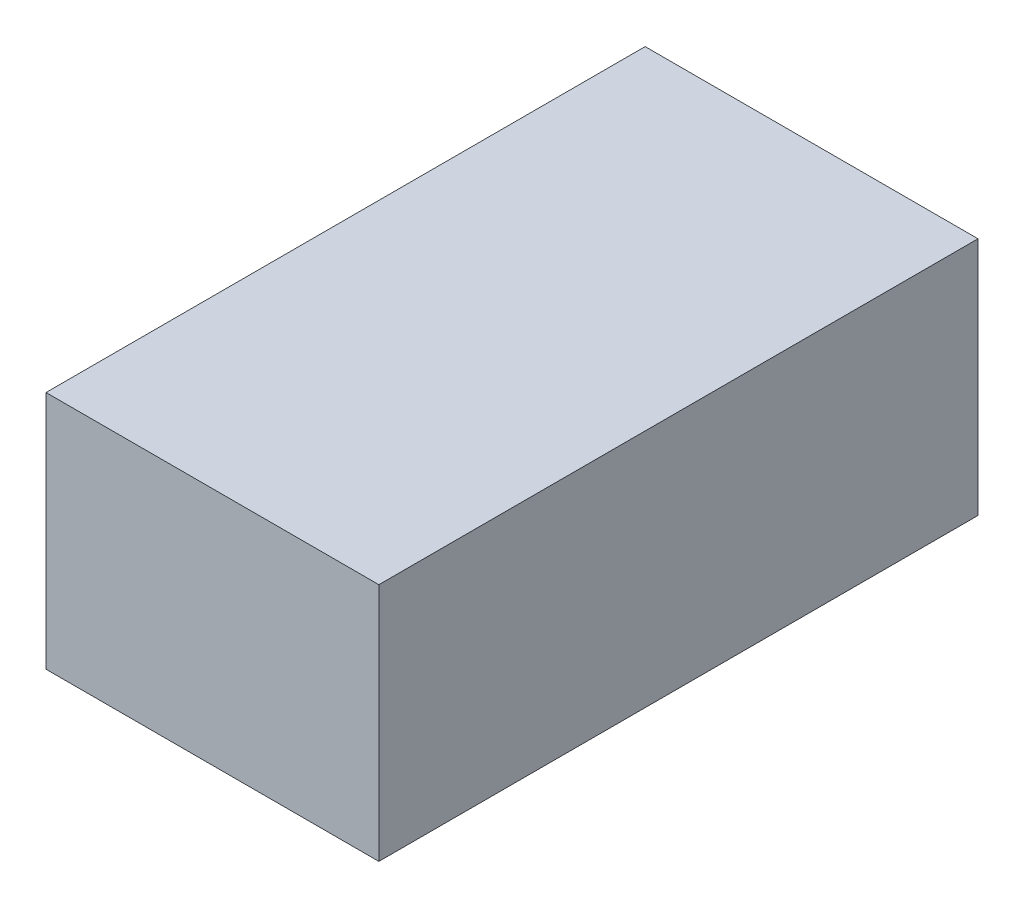
ISO-10303-21;
HEADER;
FILE_DESCRIPTION(('STEP AP214'),'2;1');
FILE_NAME('part.step','',(''),(''),'','','');
FILE_SCHEMA(('AUTOMOTIVE_DESIGN { 1 0 10303 214 1 1 1 1 }'));
ENDSEC;
DATA;
#1=APPLICATION_CONTEXT('core data for automotive mechanical design processes');
#2=APPLICATION_PROTOCOL_DEFINITION('international standard','automotive_design',2000,#1);
#3=PRODUCT_CONTEXT('',#1,'mechanical');
#4=PRODUCT('Part','Part','',(#3));
#5=PRODUCT_RELATED_PRODUCT_CATEGORY('part','',(#4));
#6=PRODUCT_DEFINITION_FORMATION('','',#4);
#7=PRODUCT_DEFINITION_CONTEXT('part definition',#1,'design');
#8=PRODUCT_DEFINITION('design','',#6,#7);
#9=PRODUCT_DEFINITION_SHAPE('','',#8);
#10=(LENGTH_UNIT() NAMED_UNIT(*) SI_UNIT(.MILLI.,.METRE.));
#11=(NAMED_UNIT(*) PLANE_ANGLE_UNIT() SI_UNIT($,.RADIAN.));
#12=(NAMED_UNIT(*) SI_UNIT($,.STERADIAN.) SOLID_ANGLE_UNIT());
#13=UNCERTAINTY_MEASURE_WITH_UNIT(LENGTH_MEASURE(1.E-05),#10,'distance_accuracy_value','');
#14=(GEOMETRIC_REPRESENTATION_CONTEXT(3) GLOBAL_UNCERTAINTY_ASSIGNED_CONTEXT((#13)) GLOBAL_UNIT_ASSIGNED_CONTEXT((#10,
#11,#12)) REPRESENTATION_CONTEXT('',''));
#15=CARTESIAN_POINT('',(0.,0.,0.));
#16=DIRECTION('',(0.,0.,1.));
#17=DIRECTION('',(1.,0.,0.));
#18=AXIS2_PLACEMENT_3D('',#15,#16,#17);
#19=CARTESIAN_POINT('',(0.,18.,0.));
#20=DIRECTION('',(1.,0.,0.));
#21=DIRECTION('',(0.,0.,-1.));
#22=AXIS2_PLACEMENT_3D('',#19,#20,#21);
#23=PLANE('',#22);
#24=DIRECTION('',(0.,0.,1.));
#25=VECTOR('',#24,1.);
#26=CARTESIAN_POINT('',(0.,0.,0.));
#27=LINE('',#26,#25);
#28=CARTESIAN_POINT('',(0.,0.,0.));
#29=VERTEX_POINT('',#28);
#30=CARTESIAN_POINT('',(0.,0.,45.));
#31=VERTEX_POINT('',#30);
#32=EDGE_CURVE('E97',#29,#31,#27,.T.);
#33=ORIENTED_EDGE('',*,*,#32,.T.);
#34=DIRECTION('',(0.,-1.,0.));
#35=VECTOR('',#34,1.);
#36=CARTESIAN_POINT('',(0.,18.,45.));
#37=LINE('',#36,#35);
#38=CARTESIAN_POINT('',(0.,18.,45.));
#39=VERTEX_POINT('',#38);
#40=EDGE_CURVE('E11',#39,#31,#37,.T.);
#41=ORIENTED_EDGE('',*,*,#40,.F.);
#42=DIRECTION('',(0.,0.,1.));
#43=VECTOR('',#42,1.);
#44=CARTESIAN_POINT('',(0.,18.,0.));
#45=LINE('',#44,#43);
#46=CARTESIAN_POINT('',(0.,18.,0.));
#47=VERTEX_POINT('',#46);
#48=EDGE_CURVE('E85',#47,#39,#45,.T.);
#49=ORIENTED_EDGE('',*,*,#48,.F.);
#50=DIRECTION('',(0.,-1.,0.));
#51=VECTOR('',#50,1.);
#52=CARTESIAN_POINT('',(0.,18.,0.));
#53=LINE('',#52,#51);
#54=EDGE_CURVE('E93',#47,#29,#53,.T.);
#55=ORIENTED_EDGE('',*,*,#54,.T.);
#56=EDGE_LOOP('',(#33,#41,#49,#55));
#57=FACE_BOUND('',#56,.T.);
#58=ADVANCED_FACE('F34',(#57),#23,.F.);
#59=CARTESIAN_POINT('',(0.,18.,45.));
#60=DIRECTION('',(0.,0.,-1.));
#61=DIRECTION('',(-1.,0.,0.));
#62=AXIS2_PLACEMENT_3D('',#59,#60,#61);
#63=PLANE('',#62);
#64=DIRECTION('',(1.,0.,0.));
#65=VECTOR('',#64,1.);
#66=CARTESIAN_POINT('',(0.,0.,45.));
#67=LINE('',#66,#65);
#68=CARTESIAN_POINT('',(25.0000000000004,0.,45.));
#69=VERTEX_POINT('',#68);
#70=EDGE_CURVE('E89',#31,#69,#67,.T.);
#71=ORIENTED_EDGE('',*,*,#70,.T.);
#72=DIRECTION('',(0.,-1.,0.));
#73=VECTOR('',#72,1.);
#74=CARTESIAN_POINT('',(25.0000000000004,18.,45.));
#75=LINE('',#74,#73);
#76=CARTESIAN_POINT('',(25.0000000000004,18.,45.));
#77=VERTEX_POINT('',#76);
#78=EDGE_CURVE('E42',#77,#69,#75,.T.);
#79=ORIENTED_EDGE('',*,*,#78,.F.);
#80=DIRECTION('',(1.,0.,0.));
#81=VECTOR('',#80,1.);
#82=CARTESIAN_POINT('',(0.,18.,45.));
#83=LINE('',#82,#81);
#84=EDGE_CURVE('E80',#39,#77,#83,.T.);
#85=ORIENTED_EDGE('',*,*,#84,.F.);
#86=ORIENTED_EDGE('',*,*,#40,.T.);
#87=EDGE_LOOP('',(#71,#79,#85,#86));
#88=FACE_BOUND('',#87,.T.);
#89=ADVANCED_FACE('F88',(#88),#63,.F.);
#90=CARTESIAN_POINT('',(25.0000000000004,18.,0.));
#91=DIRECTION('',(-1.,0.,0.));
#92=DIRECTION('',(0.,0.,1.));
#93=AXIS2_PLACEMENT_3D('',#90,#91,#92);
#94=PLANE('',#93);
#95=DIRECTION('',(0.,0.,-1.));
#96=VECTOR('',#95,1.);
#97=CARTESIAN_POINT('',(25.0000000000004,0.,0.));
#98=LINE('',#97,#96);
#99=CARTESIAN_POINT('',(25.0000000000004,0.,0.));
#100=VERTEX_POINT('',#99);
#101=EDGE_CURVE('E67',#69,#100,#98,.T.);
#102=ORIENTED_EDGE('',*,*,#101,.T.);
#103=DIRECTION('',(0.,-1.,0.));
#104=VECTOR('',#103,1.);
#105=CARTESIAN_POINT('',(25.0000000000004,18.,0.));
#106=LINE('',#105,#104);
#107=CARTESIAN_POINT('',(25.0000000000004,18.,0.));
#108=VERTEX_POINT('',#107);
#109=EDGE_CURVE('E90',#108,#100,#106,.T.);
#110=ORIENTED_EDGE('',*,*,#109,.F.);
#111=DIRECTION('',(0.,0.,-1.));
#112=VECTOR('',#111,1.);
#113=CARTESIAN_POINT('',(25.0000000000004,18.,0.));
#114=LINE('',#113,#112);
#115=EDGE_CURVE('E83',#77,#108,#114,.T.);
#116=ORIENTED_EDGE('',*,*,#115,.F.);
#117=ORIENTED_EDGE('',*,*,#78,.T.);
#118=EDGE_LOOP('',(#102,#110,#116,#117));
#119=FACE_BOUND('',#118,.T.);
#120=ADVANCED_FACE('F91',(#119),#94,.F.);
#121=CARTESIAN_POINT('',(0.,18.,0.));
#122=DIRECTION('',(0.,0.,1.));
#123=DIRECTION('',(1.,0.,0.));
#124=AXIS2_PLACEMENT_3D('',#121,#122,#123);
#125=PLANE('',#124);
#126=DIRECTION('',(-1.,0.,0.));
#127=VECTOR('',#126,1.);
#128=CARTESIAN_POINT('',(0.,0.,0.));
#129=LINE('',#128,#127);
#130=EDGE_CURVE('E73',#100,#29,#129,.T.);
#131=ORIENTED_EDGE('',*,*,#130,.T.);
#132=ORIENTED_EDGE('',*,*,#54,.F.);
#133=DIRECTION('',(-1.,0.,0.));
#134=VECTOR('',#133,1.);
#135=CARTESIAN_POINT('',(0.,18.,0.));
#136=LINE('',#135,#134);
#137=EDGE_CURVE('E50',#108,#47,#136,.T.);
#138=ORIENTED_EDGE('',*,*,#137,.F.);
#139=ORIENTED_EDGE('',*,*,#109,.T.);
#140=EDGE_LOOP('',(#131,#132,#138,#139));
#141=FACE_BOUND('',#140,.T.);
#142=ADVANCED_FACE('F104',(#141),#125,.F.);
#143=CARTESIAN_POINT('',(0.,18.,0.));
#144=DIRECTION('',(0.,1.,0.));
#145=DIRECTION('',(0.,0.,1.));
#146=AXIS2_PLACEMENT_3D('',#143,#144,#145);
#147=PLANE('',#146);
#148=ORIENTED_EDGE('',*,*,#48,.T.);
#149=ORIENTED_EDGE('',*,*,#84,.T.);
#150=ORIENTED_EDGE('',*,*,#115,.T.);
#151=ORIENTED_EDGE('',*,*,#137,.T.);
#152=EDGE_LOOP('',(#148,#149,#150,#151));
#153=FACE_BOUND('',#152,.T.);
#154=ADVANCED_FACE('F81',(#153),#147,.T.);
#155=CARTESIAN_POINT('',(0.,0.,0.));
#156=DIRECTION('',(0.,1.,0.));
#157=DIRECTION('',(0.,0.,1.));
#158=AXIS2_PLACEMENT_3D('',#155,#156,#157);
#159=PLANE('',#158);
#160=ORIENTED_EDGE('',*,*,#32,.F.);
#161=ORIENTED_EDGE('',*,*,#130,.F.);
#162=ORIENTED_EDGE('',*,*,#101,.F.);
#163=ORIENTED_EDGE('',*,*,#70,.F.);
#164=EDGE_LOOP('',(#160,#161,#162,#163));
#165=FACE_BOUND('',#164,.T.);
#166=ADVANCED_FACE('F107',(#165),#159,.F.);
#167=CLOSED_SHELL('',(#58,#89,#120,#142,#154,#166));
#168=MANIFOLD_SOLID_BREP('B2',#167);
#169=ADVANCED_BREP_SHAPE_REPRESENTATION('',(#18,#168),#14);
#170=SHAPE_DEFINITION_REPRESENTATION(#9,#169);
ENDSEC;
END-ISO-10303-21;
